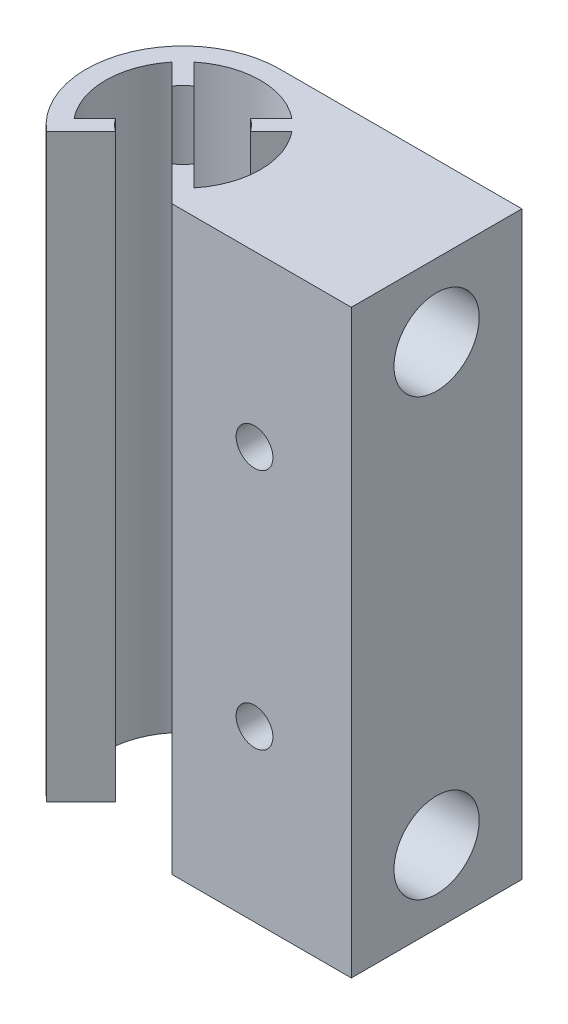
ISO-10303-21;
HEADER;
FILE_DESCRIPTION(('STEP AP214'),'2;1');
FILE_NAME('part.step','',(''),(''),'','','');
FILE_SCHEMA(('AUTOMOTIVE_DESIGN { 1 0 10303 214 1 1 1 1 }'));
ENDSEC;
DATA;
#1=APPLICATION_CONTEXT('core data for automotive mechanical design processes');
#2=APPLICATION_PROTOCOL_DEFINITION('international standard','automotive_design',2000,#1);
#3=PRODUCT_CONTEXT('',#1,'mechanical');
#4=PRODUCT('Part','Part','',(#3));
#5=PRODUCT_RELATED_PRODUCT_CATEGORY('part','',(#4));
#6=PRODUCT_DEFINITION_FORMATION('','',#4);
#7=PRODUCT_DEFINITION_CONTEXT('part definition',#1,'design');
#8=PRODUCT_DEFINITION('design','',#6,#7);
#9=PRODUCT_DEFINITION_SHAPE('','',#8);
#10=(LENGTH_UNIT() NAMED_UNIT(*) SI_UNIT(.MILLI.,.METRE.));
#11=(NAMED_UNIT(*) PLANE_ANGLE_UNIT() SI_UNIT($,.RADIAN.));
#12=(NAMED_UNIT(*) SI_UNIT($,.STERADIAN.) SOLID_ANGLE_UNIT());
#13=UNCERTAINTY_MEASURE_WITH_UNIT(LENGTH_MEASURE(1.E-05),#10,'distance_accuracy_value','');
#14=(GEOMETRIC_REPRESENTATION_CONTEXT(3) GLOBAL_UNCERTAINTY_ASSIGNED_CONTEXT((#13)) GLOBAL_UNIT_ASSIGNED_CONTEXT((#10,
#11,#12)) REPRESENTATION_CONTEXT('',''));
#15=CARTESIAN_POINT('',(0.,0.,0.));
#16=DIRECTION('',(0.,0.,1.));
#17=DIRECTION('',(1.,0.,0.));
#18=AXIS2_PLACEMENT_3D('',#15,#16,#17);
#19=CARTESIAN_POINT('',(-10.,60.,0.));
#20=DIRECTION('',(0.,-1.,0.));
#21=DIRECTION('',(0.,0.,-1.));
#22=AXIS2_PLACEMENT_3D('',#19,#20,#21);
#23=CYLINDRICAL_SURFACE('',#22,8.);
#24=CARTESIAN_POINT('',(-10.,0.,0.));
#25=DIRECTION('',(0.,-1.,0.));
#26=DIRECTION('',(0.,0.,1.));
#27=AXIS2_PLACEMENT_3D('',#24,#25,#26);
#28=CIRCLE('',#27,8.);
#29=CARTESIAN_POINT('',(-3.80581566326265,0.,-5.06281348683888));
#30=VERTEX_POINT('',#29);
#31=CARTESIAN_POINT('',(-3.80581566326265,0.,5.06281348683888));
#32=VERTEX_POINT('',#31);
#33=EDGE_CURVE('E195',#30,#32,#28,.T.);
#34=ORIENTED_EDGE('',*,*,#33,.T.);
#35=DIRECTION('',(0.,-1.,0.));
#36=VECTOR('',#35,1.);
#37=CARTESIAN_POINT('',(-3.80581566326265,60.,5.06281348683888));
#38=LINE('',#37,#36);
#39=CARTESIAN_POINT('',(-3.80581566326265,60.,5.06281348683888));
#40=VERTEX_POINT('',#39);
#41=EDGE_CURVE('E11',#40,#32,#38,.T.);
#42=ORIENTED_EDGE('',*,*,#41,.F.);
#43=CARTESIAN_POINT('',(-10.,60.,0.));
#44=DIRECTION('',(0.,-1.,0.));
#45=DIRECTION('',(0.,0.,1.));
#46=AXIS2_PLACEMENT_3D('',#43,#44,#45);
#47=CIRCLE('',#46,8.);
#48=CARTESIAN_POINT('',(-3.80581566326265,60.,-5.06281348683888));
#49=VERTEX_POINT('',#48);
#50=EDGE_CURVE('E234',#49,#40,#47,.T.);
#51=ORIENTED_EDGE('',*,*,#50,.F.);
#52=DIRECTION('',(0.,-1.,0.));
#53=VECTOR('',#52,1.);
#54=CARTESIAN_POINT('',(-3.80581566326265,60.,-5.06281348683888));
#55=LINE('',#54,#53);
#56=EDGE_CURVE('E191',#49,#30,#55,.T.);
#57=ORIENTED_EDGE('',*,*,#56,.T.);
#58=EDGE_LOOP('',(#34,#42,#51,#57));
#59=FACE_BOUND('',#58,.T.);
#60=ADVANCED_FACE('F33',(#59),#23,.F.);
#61=CARTESIAN_POINT('',(-5.94432890172773,60.,2.9243002483738));
#62=DIRECTION('',(-0.707106781186547,0.,0.707106781186548));
#63=DIRECTION('',(0.707106781186548,0.,0.707106781186547));
#64=AXIS2_PLACEMENT_3D('',#61,#62,#63);
#65=PLANE('',#64);
#66=DIRECTION('',(-0.707106781186548,0.,-0.707106781186547));
#67=VECTOR('',#66,1.);
#68=CARTESIAN_POINT('',(-5.94432890172773,0.,2.9243002483738));
#69=LINE('',#68,#67);
#70=CARTESIAN_POINT('',(-5.94432890172773,0.,2.9243002483738));
#71=VERTEX_POINT('',#70);
#72=EDGE_CURVE('E198',#32,#71,#69,.T.);
#73=ORIENTED_EDGE('',*,*,#72,.T.);
#74=DIRECTION('',(0.,-1.,0.));
#75=VECTOR('',#74,1.);
#76=CARTESIAN_POINT('',(-5.94432890172773,60.,2.9243002483738));
#77=LINE('',#76,#75);
#78=CARTESIAN_POINT('',(-5.94432890172773,60.,2.9243002483738));
#79=VERTEX_POINT('',#78);
#80=EDGE_CURVE('E41',#79,#71,#77,.T.);
#81=ORIENTED_EDGE('',*,*,#80,.F.);
#82=DIRECTION('',(-0.707106781186548,0.,-0.707106781186547));
#83=VECTOR('',#82,1.);
#84=CARTESIAN_POINT('',(-5.94432890172773,60.,2.9243002483738));
#85=LINE('',#84,#83);
#86=EDGE_CURVE('E125',#40,#79,#85,.T.);
#87=ORIENTED_EDGE('',*,*,#86,.F.);
#88=ORIENTED_EDGE('',*,*,#41,.T.);
#89=EDGE_LOOP('',(#73,#81,#87,#88));
#90=FACE_BOUND('',#89,.T.);
#91=ADVANCED_FACE('F346',(#90),#65,.F.);
#92=CARTESIAN_POINT('',(-10.,60.,0.));
#93=DIRECTION('',(0.,-1.,0.));
#94=DIRECTION('',(0.,0.,-1.));
#95=AXIS2_PLACEMENT_3D('',#92,#93,#94);
#96=CYLINDRICAL_SURFACE('',#95,5.);
#97=CARTESIAN_POINT('',(-10.,0.,0.));
#98=DIRECTION('',(0.,-1.,0.));
#99=DIRECTION('',(0.,0.,1.));
#100=AXIS2_PLACEMENT_3D('',#97,#98,#99);
#101=CIRCLE('',#100,5.);
#102=CARTESIAN_POINT('',(-7.07569975162621,0.,4.05567109827227));
#103=VERTEX_POINT('',#102);
#104=EDGE_CURVE('E201',#71,#103,#101,.T.);
#105=ORIENTED_EDGE('',*,*,#104,.T.);
#106=DIRECTION('',(0.,-1.,0.));
#107=VECTOR('',#106,1.);
#108=CARTESIAN_POINT('',(-7.07569975162621,60.,4.05567109827227));
#109=LINE('',#108,#107);
#110=CARTESIAN_POINT('',(-7.07569975162621,60.,4.05567109827227));
#111=VERTEX_POINT('',#110);
#112=EDGE_CURVE('E274',#111,#103,#109,.T.);
#113=ORIENTED_EDGE('',*,*,#112,.F.);
#114=CARTESIAN_POINT('',(-10.,60.,0.));
#115=DIRECTION('',(0.,-1.,0.));
#116=DIRECTION('',(0.,0.,1.));
#117=AXIS2_PLACEMENT_3D('',#114,#115,#116);
#118=CIRCLE('',#117,5.);
#119=EDGE_CURVE('E282',#79,#111,#118,.T.);
#120=ORIENTED_EDGE('',*,*,#119,.F.);
#121=ORIENTED_EDGE('',*,*,#80,.T.);
#122=EDGE_LOOP('',(#105,#113,#120,#121));
#123=FACE_BOUND('',#122,.T.);
#124=ADVANCED_FACE('F280',(#123),#96,.F.);
#125=CARTESIAN_POINT('',(-7.07569975162621,60.,4.05567109827227));
#126=DIRECTION('',(0.707106781186547,0.,-0.707106781186548));
#127=DIRECTION('',(-0.707106781186548,0.,-0.707106781186547));
#128=AXIS2_PLACEMENT_3D('',#125,#126,#127);
#129=PLANE('',#128);
#130=DIRECTION('',(0.707106781186548,0.,0.707106781186547));
#131=VECTOR('',#130,1.);
#132=CARTESIAN_POINT('',(-7.07569975162621,0.,4.05567109827227));
#133=LINE('',#132,#131);
#134=CARTESIAN_POINT('',(-3.5172813502668,0.,7.61408949963168));
#135=VERTEX_POINT('',#134);
#136=EDGE_CURVE('E203',#103,#135,#133,.T.);
#137=ORIENTED_EDGE('',*,*,#136,.T.);
#138=DIRECTION('',(0.,-1.,0.));
#139=VECTOR('',#138,1.);
#140=CARTESIAN_POINT('',(-3.5172813502668,60.,7.61408949963168));
#141=LINE('',#140,#139);
#142=CARTESIAN_POINT('',(-3.5172813502668,60.,7.61408949963168));
#143=VERTEX_POINT('',#142);
#144=EDGE_CURVE('E271',#143,#135,#141,.T.);
#145=ORIENTED_EDGE('',*,*,#144,.F.);
#146=DIRECTION('',(0.707106781186548,0.,0.707106781186547));
#147=VECTOR('',#146,1.);
#148=CARTESIAN_POINT('',(-7.07569975162621,60.,4.05567109827227));
#149=LINE('',#148,#147);
#150=EDGE_CURVE('E299',#111,#143,#149,.T.);
#151=ORIENTED_EDGE('',*,*,#150,.F.);
#152=ORIENTED_EDGE('',*,*,#112,.T.);
#153=EDGE_LOOP('',(#137,#145,#151,#152));
#154=FACE_BOUND('',#153,.T.);
#155=ADVANCED_FACE('F290',(#154),#129,.F.);
#156=CARTESIAN_POINT('',(-3.5172813502668,60.,7.61408949963168));
#157=DIRECTION('',(0.,0.,-1.));
#158=DIRECTION('',(-1.,0.,0.));
#159=AXIS2_PLACEMENT_3D('',#156,#157,#158);
#160=PLANE('',#159);
#161=CARTESIAN_POINT('',(4.99999999999999,17.5,7.61408949963168));
#162=DIRECTION('',(0.,0.,-1.));
#163=DIRECTION('',(-1.,0.,0.));
#164=AXIS2_PLACEMENT_3D('',#161,#162,#163);
#165=CIRCLE('',#164,1.9);
#166=CARTESIAN_POINT('',(3.1,17.5,7.61408949963168));
#167=VERTEX_POINT('',#166);
#168=EDGE_CURVE('E529',#167,#167,#165,.F.);
#169=ORIENTED_EDGE('',*,*,#168,.F.);
#170=EDGE_LOOP('',(#169));
#171=FACE_BOUND('',#170,.T.);
#172=CARTESIAN_POINT('',(5.,42.5,7.61408949963168));
#173=DIRECTION('',(0.,0.,-1.));
#174=DIRECTION('',(-1.,0.,0.));
#175=AXIS2_PLACEMENT_3D('',#172,#173,#174);
#176=CIRCLE('',#175,1.9);
#177=CARTESIAN_POINT('',(3.1,42.5,7.61408949963168));
#178=VERTEX_POINT('',#177);
#179=EDGE_CURVE('E199',#178,#178,#176,.F.);
#180=ORIENTED_EDGE('',*,*,#179,.F.);
#181=EDGE_LOOP('',(#180));
#182=FACE_BOUND('',#181,.T.);
#183=DIRECTION('',(1.,0.,0.));
#184=VECTOR('',#183,1.);
#185=CARTESIAN_POINT('',(-3.5172813502668,0.,7.61408949963168));
#186=LINE('',#185,#184);
#187=CARTESIAN_POINT('',(15.,0.,7.61408949963168));
#188=VERTEX_POINT('',#187);
#189=EDGE_CURVE('E205',#135,#188,#186,.T.);
#190=ORIENTED_EDGE('',*,*,#189,.T.);
#191=DIRECTION('',(0.,-1.,0.));
#192=VECTOR('',#191,1.);
#193=CARTESIAN_POINT('',(15.,60.,7.61408949963168));
#194=LINE('',#193,#192);
#195=CARTESIAN_POINT('',(15.,60.,7.61408949963168));
#196=VERTEX_POINT('',#195);
#197=EDGE_CURVE('E268',#196,#188,#194,.T.);
#198=ORIENTED_EDGE('',*,*,#197,.F.);
#199=DIRECTION('',(1.,0.,0.));
#200=VECTOR('',#199,1.);
#201=CARTESIAN_POINT('',(-3.5172813502668,60.,7.61408949963168));
#202=LINE('',#201,#200);
#203=EDGE_CURVE('E296',#143,#196,#202,.T.);
#204=ORIENTED_EDGE('',*,*,#203,.F.);
#205=ORIENTED_EDGE('',*,*,#144,.T.);
#206=EDGE_LOOP('',(#190,#198,#204,#205));
#207=FACE_BOUND('',#206,.T.);
#208=ADVANCED_FACE('F294',(#171,#182,#207),#160,.F.);
#209=CARTESIAN_POINT('',(15.,60.,-1.19295525018416));
#210=DIRECTION('',(-1.,0.,0.));
#211=DIRECTION('',(0.,0.,1.));
#212=AXIS2_PLACEMENT_3D('',#209,#210,#211);
#213=PLANE('',#212);
#214=CARTESIAN_POINT('',(15.,52.5,-1.19295525018416));
#215=DIRECTION('',(1.,0.,0.));
#216=DIRECTION('',(0.,0.,-1.));
#217=AXIS2_PLACEMENT_3D('',#214,#215,#216);
#218=CIRCLE('',#217,4.4);
#219=CARTESIAN_POINT('',(15.,52.5,-5.59295525018416));
#220=VERTEX_POINT('',#219);
#221=EDGE_CURVE('E516',#220,#220,#218,.T.);
#222=ORIENTED_EDGE('',*,*,#221,.F.);
#223=EDGE_LOOP('',(#222));
#224=FACE_BOUND('',#223,.T.);
#225=CARTESIAN_POINT('',(15.,7.5,-1.19295525018417));
#226=DIRECTION('',(1.,0.,0.));
#227=DIRECTION('',(0.,0.,-1.));
#228=AXIS2_PLACEMENT_3D('',#225,#226,#227);
#229=CIRCLE('',#228,4.4);
#230=CARTESIAN_POINT('',(15.,7.5,-5.59295525018417));
#231=VERTEX_POINT('',#230);
#232=EDGE_CURVE('E515',#231,#231,#229,.T.);
#233=ORIENTED_EDGE('',*,*,#232,.F.);
#234=EDGE_LOOP('',(#233));
#235=FACE_BOUND('',#234,.T.);
#236=DIRECTION('',(0.,0.,-1.));
#237=VECTOR('',#236,1.);
#238=CARTESIAN_POINT('',(15.,0.,-1.19295525018416));
#239=LINE('',#238,#237);
#240=CARTESIAN_POINT('',(15.,0.,-10.));
#241=VERTEX_POINT('',#240);
#242=EDGE_CURVE('E208',#188,#241,#239,.T.);
#243=ORIENTED_EDGE('',*,*,#242,.T.);
#244=DIRECTION('',(0.,-1.,0.));
#245=VECTOR('',#244,1.);
#246=CARTESIAN_POINT('',(15.,60.,-10.));
#247=LINE('',#246,#245);
#248=CARTESIAN_POINT('',(15.,60.,-10.));
#249=VERTEX_POINT('',#248);
#250=EDGE_CURVE('E265',#249,#241,#247,.T.);
#251=ORIENTED_EDGE('',*,*,#250,.F.);
#252=DIRECTION('',(0.,0.,-1.));
#253=VECTOR('',#252,1.);
#254=CARTESIAN_POINT('',(15.,60.,-1.19295525018416));
#255=LINE('',#254,#253);
#256=EDGE_CURVE('E298',#196,#249,#255,.T.);
#257=ORIENTED_EDGE('',*,*,#256,.F.);
#258=ORIENTED_EDGE('',*,*,#197,.T.);
#259=EDGE_LOOP('',(#243,#251,#257,#258));
#260=FACE_BOUND('',#259,.T.);
#261=ADVANCED_FACE('F359',(#224,#235,#260),#213,.F.);
#262=CARTESIAN_POINT('',(0.,60.,-10.));
#263=DIRECTION('',(0.,0.,1.));
#264=DIRECTION('',(1.,0.,0.));
#265=AXIS2_PLACEMENT_3D('',#262,#263,#264);
#266=PLANE('',#265);
#267=CARTESIAN_POINT('',(4.99999999999999,17.5,-10.));
#268=DIRECTION('',(0.,0.,-1.));
#269=DIRECTION('',(-1.,0.,0.));
#270=AXIS2_PLACEMENT_3D('',#267,#268,#269);
#271=CIRCLE('',#270,1.9);
#272=CARTESIAN_POINT('',(3.1,17.5,-10.));
#273=VERTEX_POINT('',#272);
#274=EDGE_CURVE('E525',#273,#273,#271,.T.);
#275=ORIENTED_EDGE('',*,*,#274,.F.);
#276=EDGE_LOOP('',(#275));
#277=FACE_BOUND('',#276,.T.);
#278=CARTESIAN_POINT('',(5.,42.5,-10.));
#279=DIRECTION('',(0.,0.,-1.));
#280=DIRECTION('',(-1.,0.,0.));
#281=AXIS2_PLACEMENT_3D('',#278,#279,#280);
#282=CIRCLE('',#281,1.9);
#283=CARTESIAN_POINT('',(3.1,42.5,-10.));
#284=VERTEX_POINT('',#283);
#285=EDGE_CURVE('E532',#284,#284,#282,.T.);
#286=ORIENTED_EDGE('',*,*,#285,.F.);
#287=EDGE_LOOP('',(#286));
#288=FACE_BOUND('',#287,.T.);
#289=DIRECTION('',(-1.,0.,0.));
#290=VECTOR('',#289,1.);
#291=CARTESIAN_POINT('',(0.,0.,-10.));
#292=LINE('',#291,#290);
#293=CARTESIAN_POINT('',(-10.,0.,-10.));
#294=VERTEX_POINT('',#293);
#295=EDGE_CURVE('E211',#241,#294,#292,.T.);
#296=ORIENTED_EDGE('',*,*,#295,.T.);
#297=DIRECTION('',(0.,-1.,0.));
#298=VECTOR('',#297,1.);
#299=CARTESIAN_POINT('',(-10.,60.,-10.));
#300=LINE('',#299,#298);
#301=CARTESIAN_POINT('',(-10.,60.,-10.));
#302=VERTEX_POINT('',#301);
#303=EDGE_CURVE('E262',#302,#294,#300,.T.);
#304=ORIENTED_EDGE('',*,*,#303,.F.);
#305=DIRECTION('',(-1.,0.,0.));
#306=VECTOR('',#305,1.);
#307=CARTESIAN_POINT('',(0.,60.,-10.));
#308=LINE('',#307,#306);
#309=EDGE_CURVE('E301',#249,#302,#308,.T.);
#310=ORIENTED_EDGE('',*,*,#309,.F.);
#311=ORIENTED_EDGE('',*,*,#250,.T.);
#312=EDGE_LOOP('',(#296,#304,#310,#311));
#313=FACE_BOUND('',#312,.T.);
#314=ADVANCED_FACE('F363',(#277,#288,#313),#266,.F.);
#315=CARTESIAN_POINT('',(-10.,60.,0.));
#316=DIRECTION('',(0.,-1.,0.));
#317=DIRECTION('',(0.,0.,-1.));
#318=AXIS2_PLACEMENT_3D('',#315,#316,#317);
#319=CYLINDRICAL_SURFACE('',#318,10.);
#320=CARTESIAN_POINT('',(-10.,0.,0.));
#321=DIRECTION('',(0.,1.,0.));
#322=DIRECTION('',(0.,0.,1.));
#323=AXIS2_PLACEMENT_3D('',#320,#321,#322);
#324=CIRCLE('',#323,10.);
#325=CARTESIAN_POINT('',(-16.4827186497332,0.,7.61408949963168));
#326=VERTEX_POINT('',#325);
#327=EDGE_CURVE('E213',#294,#326,#324,.T.);
#328=ORIENTED_EDGE('',*,*,#327,.T.);
#329=DIRECTION('',(0.,-1.,0.));
#330=VECTOR('',#329,1.);
#331=CARTESIAN_POINT('',(-16.4827186497332,60.,7.61408949963168));
#332=LINE('',#331,#330);
#333=CARTESIAN_POINT('',(-16.4827186497332,60.,7.61408949963168));
#334=VERTEX_POINT('',#333);
#335=EDGE_CURVE('E259',#334,#326,#332,.T.);
#336=ORIENTED_EDGE('',*,*,#335,.F.);
#337=CARTESIAN_POINT('',(-10.,60.,0.));
#338=DIRECTION('',(0.,1.,0.));
#339=DIRECTION('',(0.,0.,1.));
#340=AXIS2_PLACEMENT_3D('',#337,#338,#339);
#341=CIRCLE('',#340,10.);
#342=EDGE_CURVE('E307',#302,#334,#341,.T.);
#343=ORIENTED_EDGE('',*,*,#342,.F.);
#344=ORIENTED_EDGE('',*,*,#303,.T.);
#345=EDGE_LOOP('',(#328,#336,#343,#344));
#346=FACE_BOUND('',#345,.T.);
#347=ADVANCED_FACE('F367',(#346),#319,.T.);
#348=CARTESIAN_POINT('',(-12.9243002483738,60.,4.05567109827227));
#349=DIRECTION('',(-0.707106781186548,0.,-0.707106781186547));
#350=DIRECTION('',(-0.707106781186547,0.,0.707106781186548));
#351=AXIS2_PLACEMENT_3D('',#348,#349,#350);
#352=PLANE('',#351);
#353=DIRECTION('',(0.707106781186547,0.,-0.707106781186548));
#354=VECTOR('',#353,1.);
#355=CARTESIAN_POINT('',(-12.9243002483738,0.,4.05567109827227));
#356=LINE('',#355,#354);
#357=CARTESIAN_POINT('',(-12.9243002483738,0.,4.05567109827227));
#358=VERTEX_POINT('',#357);
#359=EDGE_CURVE('E215',#326,#358,#356,.T.);
#360=ORIENTED_EDGE('',*,*,#359,.T.);
#361=DIRECTION('',(0.,-1.,0.));
#362=VECTOR('',#361,1.);
#363=CARTESIAN_POINT('',(-12.9243002483738,60.,4.05567109827227));
#364=LINE('',#363,#362);
#365=CARTESIAN_POINT('',(-12.9243002483738,60.,4.05567109827227));
#366=VERTEX_POINT('',#365);
#367=EDGE_CURVE('E256',#366,#358,#364,.T.);
#368=ORIENTED_EDGE('',*,*,#367,.F.);
#369=DIRECTION('',(0.707106781186547,0.,-0.707106781186548));
#370=VECTOR('',#369,1.);
#371=CARTESIAN_POINT('',(-12.9243002483738,60.,4.05567109827227));
#372=LINE('',#371,#370);
#373=EDGE_CURVE('E309',#334,#366,#372,.T.);
#374=ORIENTED_EDGE('',*,*,#373,.F.);
#375=ORIENTED_EDGE('',*,*,#335,.T.);
#376=EDGE_LOOP('',(#360,#368,#374,#375));
#377=FACE_BOUND('',#376,.T.);
#378=ADVANCED_FACE('F371',(#377),#352,.F.);
#379=CARTESIAN_POINT('',(-10.,60.,0.));
#380=DIRECTION('',(0.,-1.,0.));
#381=DIRECTION('',(0.,0.,-1.));
#382=AXIS2_PLACEMENT_3D('',#379,#380,#381);
#383=CYLINDRICAL_SURFACE('',#382,4.99999999999995);
#384=CARTESIAN_POINT('',(-10.,0.,0.));
#385=DIRECTION('',(0.,-1.,0.));
#386=DIRECTION('',(0.,0.,1.));
#387=AXIS2_PLACEMENT_3D('',#384,#385,#386);
#388=CIRCLE('',#387,4.99999999999995);
#389=CARTESIAN_POINT('',(-14.0556710982722,0.,2.92430024837375));
#390=VERTEX_POINT('',#389);
#391=EDGE_CURVE('E217',#358,#390,#388,.T.);
#392=ORIENTED_EDGE('',*,*,#391,.T.);
#393=DIRECTION('',(0.,-1.,0.));
#394=VECTOR('',#393,1.);
#395=CARTESIAN_POINT('',(-14.0556710982722,60.,2.92430024837375));
#396=LINE('',#395,#394);
#397=CARTESIAN_POINT('',(-14.0556710982722,60.,2.92430024837375));
#398=VERTEX_POINT('',#397);
#399=EDGE_CURVE('E253',#398,#390,#396,.T.);
#400=ORIENTED_EDGE('',*,*,#399,.F.);
#401=CARTESIAN_POINT('',(-10.,60.,0.));
#402=DIRECTION('',(0.,-1.,0.));
#403=DIRECTION('',(0.,0.,1.));
#404=AXIS2_PLACEMENT_3D('',#401,#402,#403);
#405=CIRCLE('',#404,4.99999999999995);
#406=EDGE_CURVE('E311',#366,#398,#405,.T.);
#407=ORIENTED_EDGE('',*,*,#406,.F.);
#408=ORIENTED_EDGE('',*,*,#367,.T.);
#409=EDGE_LOOP('',(#392,#400,#407,#408));
#410=FACE_BOUND('',#409,.T.);
#411=ADVANCED_FACE('F375',(#410),#383,.F.);
#412=CARTESIAN_POINT('',(-14.0556710982722,60.,2.92430024837372));
#413=DIRECTION('',(0.707106781186546,0.,0.707106781186549));
#414=DIRECTION('',(0.707106781186549,0.,-0.707106781186546));
#415=AXIS2_PLACEMENT_3D('',#412,#413,#414);
#416=PLANE('',#415);
#417=DIRECTION('',(-0.707106781186549,0.,0.707106781186546));
#418=VECTOR('',#417,1.);
#419=CARTESIAN_POINT('',(-14.0556710982722,0.,2.92430024837372));
#420=LINE('',#419,#418);
#421=CARTESIAN_POINT('',(-16.1941843367374,0.,5.06281348683888));
#422=VERTEX_POINT('',#421);
#423=EDGE_CURVE('E219',#390,#422,#420,.T.);
#424=ORIENTED_EDGE('',*,*,#423,.T.);
#425=DIRECTION('',(0.,-1.,0.));
#426=VECTOR('',#425,1.);
#427=CARTESIAN_POINT('',(-16.1941843367374,60.,5.06281348683888));
#428=LINE('',#427,#426);
#429=CARTESIAN_POINT('',(-16.1941843367374,60.,5.06281348683888));
#430=VERTEX_POINT('',#429);
#431=EDGE_CURVE('E250',#430,#422,#428,.T.);
#432=ORIENTED_EDGE('',*,*,#431,.F.);
#433=DIRECTION('',(-0.707106781186549,0.,0.707106781186546));
#434=VECTOR('',#433,1.);
#435=CARTESIAN_POINT('',(-14.0556710982722,60.,2.92430024837372));
#436=LINE('',#435,#434);
#437=EDGE_CURVE('E313',#398,#430,#436,.T.);
#438=ORIENTED_EDGE('',*,*,#437,.F.);
#439=ORIENTED_EDGE('',*,*,#399,.T.);
#440=EDGE_LOOP('',(#424,#432,#438,#439));
#441=FACE_BOUND('',#440,.T.);
#442=ADVANCED_FACE('F379',(#441),#416,.F.);
#443=CARTESIAN_POINT('',(-10.,60.,0.));
#444=DIRECTION('',(0.,-1.,0.));
#445=DIRECTION('',(0.,0.,-1.));
#446=AXIS2_PLACEMENT_3D('',#443,#444,#445);
#447=CYLINDRICAL_SURFACE('',#446,8.);
#448=CARTESIAN_POINT('',(-10.,0.,0.));
#449=DIRECTION('',(0.,-1.,0.));
#450=DIRECTION('',(0.,0.,1.));
#451=AXIS2_PLACEMENT_3D('',#448,#449,#450);
#452=CIRCLE('',#451,8.);
#453=CARTESIAN_POINT('',(-16.1941843367374,0.,-5.06281348683887));
#454=VERTEX_POINT('',#453);
#455=EDGE_CURVE('E221',#422,#454,#452,.T.);
#456=ORIENTED_EDGE('',*,*,#455,.T.);
#457=DIRECTION('',(0.,-1.,0.));
#458=VECTOR('',#457,1.);
#459=CARTESIAN_POINT('',(-16.1941843367374,60.,-5.06281348683887));
#460=LINE('',#459,#458);
#461=CARTESIAN_POINT('',(-16.1941843367374,60.,-5.06281348683887));
#462=VERTEX_POINT('',#461);
#463=EDGE_CURVE('E247',#462,#454,#460,.T.);
#464=ORIENTED_EDGE('',*,*,#463,.F.);
#465=CARTESIAN_POINT('',(-10.,60.,0.));
#466=DIRECTION('',(0.,-1.,0.));
#467=DIRECTION('',(0.,0.,1.));
#468=AXIS2_PLACEMENT_3D('',#465,#466,#467);
#469=CIRCLE('',#468,8.);
#470=EDGE_CURVE('E315',#430,#462,#469,.T.);
#471=ORIENTED_EDGE('',*,*,#470,.F.);
#472=ORIENTED_EDGE('',*,*,#431,.T.);
#473=EDGE_LOOP('',(#456,#464,#471,#472));
#474=FACE_BOUND('',#473,.T.);
#475=ADVANCED_FACE('F383',(#474),#447,.F.);
#476=CARTESIAN_POINT('',(-14.0556710982723,60.,-2.92430024837379));
#477=DIRECTION('',(0.707106781186545,0.,-0.70710678118655));
#478=DIRECTION('',(-0.70710678118655,0.,-0.707106781186545));
#479=AXIS2_PLACEMENT_3D('',#476,#477,#478);
#480=PLANE('',#479);
#481=DIRECTION('',(0.70710678118655,0.,0.707106781186545));
#482=VECTOR('',#481,1.);
#483=CARTESIAN_POINT('',(-14.0556710982723,0.,-2.92430024837379));
#484=LINE('',#483,#482);
#485=CARTESIAN_POINT('',(-14.0556710982723,0.,-2.92430024837379));
#486=VERTEX_POINT('',#485);
#487=EDGE_CURVE('E223',#454,#486,#484,.T.);
#488=ORIENTED_EDGE('',*,*,#487,.T.);
#489=DIRECTION('',(0.,-1.,0.));
#490=VECTOR('',#489,1.);
#491=CARTESIAN_POINT('',(-14.0556710982723,60.,-2.92430024837379));
#492=LINE('',#491,#490);
#493=CARTESIAN_POINT('',(-14.0556710982723,60.,-2.92430024837379));
#494=VERTEX_POINT('',#493);
#495=EDGE_CURVE('E244',#494,#486,#492,.T.);
#496=ORIENTED_EDGE('',*,*,#495,.F.);
#497=DIRECTION('',(0.70710678118655,0.,0.707106781186545));
#498=VECTOR('',#497,1.);
#499=CARTESIAN_POINT('',(-14.0556710982723,60.,-2.92430024837379));
#500=LINE('',#499,#498);
#501=EDGE_CURVE('E317',#462,#494,#500,.T.);
#502=ORIENTED_EDGE('',*,*,#501,.F.);
#503=ORIENTED_EDGE('',*,*,#463,.T.);
#504=EDGE_LOOP('',(#488,#496,#502,#503));
#505=FACE_BOUND('',#504,.T.);
#506=ADVANCED_FACE('F387',(#505),#480,.F.);
#507=CARTESIAN_POINT('',(-10.,60.,0.));
#508=DIRECTION('',(0.,-1.,0.));
#509=DIRECTION('',(0.,0.,-1.));
#510=AXIS2_PLACEMENT_3D('',#507,#508,#509);
#511=CYLINDRICAL_SURFACE('',#510,5.);
#512=CARTESIAN_POINT('',(-10.,0.,0.));
#513=DIRECTION('',(0.,-1.,0.));
#514=DIRECTION('',(0.,0.,1.));
#515=AXIS2_PLACEMENT_3D('',#512,#513,#514);
#516=CIRCLE('',#515,5.);
#517=CARTESIAN_POINT('',(-12.9243002483738,0.,-4.05567109827227));
#518=VERTEX_POINT('',#517);
#519=EDGE_CURVE('E225',#486,#518,#516,.T.);
#520=ORIENTED_EDGE('',*,*,#519,.T.);
#521=DIRECTION('',(0.,-1.,0.));
#522=VECTOR('',#521,1.);
#523=CARTESIAN_POINT('',(-12.9243002483738,60.,-4.05567109827227));
#524=LINE('',#523,#522);
#525=CARTESIAN_POINT('',(-12.9243002483738,60.,-4.05567109827227));
#526=VERTEX_POINT('',#525);
#527=EDGE_CURVE('E241',#526,#518,#524,.T.);
#528=ORIENTED_EDGE('',*,*,#527,.F.);
#529=CARTESIAN_POINT('',(-10.,60.,0.));
#530=DIRECTION('',(0.,-1.,0.));
#531=DIRECTION('',(0.,0.,1.));
#532=AXIS2_PLACEMENT_3D('',#529,#530,#531);
#533=CIRCLE('',#532,5.);
#534=EDGE_CURVE('E319',#494,#526,#533,.T.);
#535=ORIENTED_EDGE('',*,*,#534,.F.);
#536=ORIENTED_EDGE('',*,*,#495,.T.);
#537=EDGE_LOOP('',(#520,#528,#535,#536));
#538=FACE_BOUND('',#537,.T.);
#539=ADVANCED_FACE('F391',(#538),#511,.F.);
#540=CARTESIAN_POINT('',(-15.0628134868389,60.,-6.19418433673735));
#541=DIRECTION('',(-0.707106781186548,0.,0.707106781186547));
#542=DIRECTION('',(0.707106781186547,0.,0.707106781186548));
#543=AXIS2_PLACEMENT_3D('',#540,#541,#542);
#544=PLANE('',#543);
#545=DIRECTION('',(-0.707106781186547,0.,-0.707106781186548));
#546=VECTOR('',#545,1.);
#547=CARTESIAN_POINT('',(-15.0628134868389,0.,-6.19418433673735));
#548=LINE('',#547,#546);
#549=CARTESIAN_POINT('',(-15.0628134868389,0.,-6.19418433673735));
#550=VERTEX_POINT('',#549);
#551=EDGE_CURVE('E227',#518,#550,#548,.T.);
#552=ORIENTED_EDGE('',*,*,#551,.T.);
#553=DIRECTION('',(0.,-1.,0.));
#554=VECTOR('',#553,1.);
#555=CARTESIAN_POINT('',(-15.0628134868389,60.,-6.19418433673735));
#556=LINE('',#555,#554);
#557=CARTESIAN_POINT('',(-15.0628134868389,60.,-6.19418433673735));
#558=VERTEX_POINT('',#557);
#559=EDGE_CURVE('E238',#558,#550,#556,.T.);
#560=ORIENTED_EDGE('',*,*,#559,.F.);
#561=DIRECTION('',(-0.707106781186547,0.,-0.707106781186548));
#562=VECTOR('',#561,1.);
#563=CARTESIAN_POINT('',(-15.0628134868389,60.,-6.19418433673735));
#564=LINE('',#563,#562);
#565=EDGE_CURVE('E321',#526,#558,#564,.T.);
#566=ORIENTED_EDGE('',*,*,#565,.F.);
#567=ORIENTED_EDGE('',*,*,#527,.T.);
#568=EDGE_LOOP('',(#552,#560,#566,#567));
#569=FACE_BOUND('',#568,.T.);
#570=ADVANCED_FACE('F327',(#569),#544,.F.);
#571=CARTESIAN_POINT('',(-10.,60.,0.));
#572=DIRECTION('',(0.,-1.,0.));
#573=DIRECTION('',(0.,0.,-1.));
#574=AXIS2_PLACEMENT_3D('',#571,#572,#573);
#575=CYLINDRICAL_SURFACE('',#574,8.);
#576=CARTESIAN_POINT('',(-10.,0.,0.));
#577=DIRECTION('',(0.,-1.,0.));
#578=DIRECTION('',(0.,0.,1.));
#579=AXIS2_PLACEMENT_3D('',#576,#577,#578);
#580=CIRCLE('',#579,8.);
#581=CARTESIAN_POINT('',(-4.93718651316113,0.,-6.19418433673735));
#582=VERTEX_POINT('',#581);
#583=EDGE_CURVE('E229',#550,#582,#580,.T.);
#584=ORIENTED_EDGE('',*,*,#583,.T.);
#585=DIRECTION('',(0.,-1.,0.));
#586=VECTOR('',#585,1.);
#587=CARTESIAN_POINT('',(-4.93718651316113,60.,-6.19418433673735));
#588=LINE('',#587,#586);
#589=CARTESIAN_POINT('',(-4.93718651316113,60.,-6.19418433673735));
#590=VERTEX_POINT('',#589);
#591=EDGE_CURVE('E186',#590,#582,#588,.T.);
#592=ORIENTED_EDGE('',*,*,#591,.F.);
#593=CARTESIAN_POINT('',(-10.,60.,0.));
#594=DIRECTION('',(0.,-1.,0.));
#595=DIRECTION('',(0.,0.,1.));
#596=AXIS2_PLACEMENT_3D('',#593,#594,#595);
#597=CIRCLE('',#596,8.);
#598=EDGE_CURVE('E177',#558,#590,#597,.T.);
#599=ORIENTED_EDGE('',*,*,#598,.F.);
#600=ORIENTED_EDGE('',*,*,#559,.T.);
#601=EDGE_LOOP('',(#584,#592,#599,#600));
#602=FACE_BOUND('',#601,.T.);
#603=ADVANCED_FACE('F331',(#602),#575,.F.);
#604=CARTESIAN_POINT('',(-7.07569975162621,60.,-4.05567109827227));
#605=DIRECTION('',(0.707106781186547,0.,0.707106781186547));
#606=DIRECTION('',(0.707106781186548,0.,-0.707106781186548));
#607=AXIS2_PLACEMENT_3D('',#604,#605,#606);
#608=PLANE('',#607);
#609=DIRECTION('',(-0.707106781186547,0.,0.707106781186547));
#610=VECTOR('',#609,1.);
#611=CARTESIAN_POINT('',(-7.07569975162621,0.,-4.05567109827227));
#612=LINE('',#611,#610);
#613=CARTESIAN_POINT('',(-7.07569975162621,0.,-4.05567109827227));
#614=VERTEX_POINT('',#613);
#615=EDGE_CURVE('E185',#582,#614,#612,.T.);
#616=ORIENTED_EDGE('',*,*,#615,.T.);
#617=DIRECTION('',(0.,-1.,0.));
#618=VECTOR('',#617,1.);
#619=CARTESIAN_POINT('',(-7.07569975162621,60.,-4.05567109827227));
#620=LINE('',#619,#618);
#621=CARTESIAN_POINT('',(-7.07569975162621,60.,-4.05567109827227));
#622=VERTEX_POINT('',#621);
#623=EDGE_CURVE('E182',#622,#614,#620,.T.);
#624=ORIENTED_EDGE('',*,*,#623,.F.);
#625=DIRECTION('',(-0.707106781186547,0.,0.707106781186547));
#626=VECTOR('',#625,1.);
#627=CARTESIAN_POINT('',(-7.07569975162621,60.,-4.05567109827227));
#628=LINE('',#627,#626);
#629=EDGE_CURVE('E171',#590,#622,#628,.T.);
#630=ORIENTED_EDGE('',*,*,#629,.F.);
#631=ORIENTED_EDGE('',*,*,#591,.T.);
#632=EDGE_LOOP('',(#616,#624,#630,#631));
#633=FACE_BOUND('',#632,.T.);
#634=ADVANCED_FACE('F183',(#633),#608,.F.);
#635=CARTESIAN_POINT('',(-10.,60.,0.));
#636=DIRECTION('',(0.,-1.,0.));
#637=DIRECTION('',(0.,0.,-1.));
#638=AXIS2_PLACEMENT_3D('',#635,#636,#637);
#639=CYLINDRICAL_SURFACE('',#638,5.);
#640=CARTESIAN_POINT('',(-10.,0.,0.));
#641=DIRECTION('',(0.,-1.,0.));
#642=DIRECTION('',(0.,0.,1.));
#643=AXIS2_PLACEMENT_3D('',#640,#641,#642);
#644=CIRCLE('',#643,5.);
#645=CARTESIAN_POINT('',(-5.94432890172773,0.,-2.92430024837379));
#646=VERTEX_POINT('',#645);
#647=EDGE_CURVE('E111',#614,#646,#644,.T.);
#648=ORIENTED_EDGE('',*,*,#647,.T.);
#649=DIRECTION('',(0.,-1.,0.));
#650=VECTOR('',#649,1.);
#651=CARTESIAN_POINT('',(-5.94432890172773,60.,-2.92430024837379));
#652=LINE('',#651,#650);
#653=CARTESIAN_POINT('',(-5.94432890172773,60.,-2.92430024837379));
#654=VERTEX_POINT('',#653);
#655=EDGE_CURVE('E187',#654,#646,#652,.T.);
#656=ORIENTED_EDGE('',*,*,#655,.F.);
#657=CARTESIAN_POINT('',(-10.,60.,0.));
#658=DIRECTION('',(0.,-1.,0.));
#659=DIRECTION('',(0.,0.,1.));
#660=AXIS2_PLACEMENT_3D('',#657,#658,#659);
#661=CIRCLE('',#660,5.);
#662=EDGE_CURVE('E175',#622,#654,#661,.T.);
#663=ORIENTED_EDGE('',*,*,#662,.F.);
#664=ORIENTED_EDGE('',*,*,#623,.T.);
#665=EDGE_LOOP('',(#648,#656,#663,#664));
#666=FACE_BOUND('',#665,.T.);
#667=ADVANCED_FACE('F189',(#666),#639,.F.);
#668=CARTESIAN_POINT('',(-5.94432890172773,60.,-2.92430024837379));
#669=DIRECTION('',(-0.707106781186547,0.,-0.707106781186548));
#670=DIRECTION('',(-0.707106781186548,0.,0.707106781186547));
#671=AXIS2_PLACEMENT_3D('',#668,#669,#670);
#672=PLANE('',#671);
#673=DIRECTION('',(0.707106781186548,0.,-0.707106781186547));
#674=VECTOR('',#673,1.);
#675=CARTESIAN_POINT('',(-5.94432890172773,0.,-2.92430024837379));
#676=LINE('',#675,#674);
#677=EDGE_CURVE('E117',#646,#30,#676,.T.);
#678=ORIENTED_EDGE('',*,*,#677,.T.);
#679=ORIENTED_EDGE('',*,*,#56,.F.);
#680=DIRECTION('',(0.707106781186548,0.,-0.707106781186547));
#681=VECTOR('',#680,1.);
#682=CARTESIAN_POINT('',(-5.94432890172773,60.,-2.92430024837379));
#683=LINE('',#682,#681);
#684=EDGE_CURVE('E49',#654,#49,#683,.T.);
#685=ORIENTED_EDGE('',*,*,#684,.F.);
#686=ORIENTED_EDGE('',*,*,#655,.T.);
#687=EDGE_LOOP('',(#678,#679,#685,#686));
#688=FACE_BOUND('',#687,.T.);
#689=ADVANCED_FACE('F335',(#688),#672,.F.);
#690=CARTESIAN_POINT('',(-10.,60.,0.));
#691=DIRECTION('',(0.,1.,0.));
#692=DIRECTION('',(0.,0.,1.));
#693=AXIS2_PLACEMENT_3D('',#690,#691,#692);
#694=PLANE('',#693);
#695=ORIENTED_EDGE('',*,*,#50,.T.);
#696=ORIENTED_EDGE('',*,*,#86,.T.);
#697=ORIENTED_EDGE('',*,*,#119,.T.);
#698=ORIENTED_EDGE('',*,*,#150,.T.);
#699=ORIENTED_EDGE('',*,*,#203,.T.);
#700=ORIENTED_EDGE('',*,*,#256,.T.);
#701=ORIENTED_EDGE('',*,*,#309,.T.);
#702=ORIENTED_EDGE('',*,*,#342,.T.);
#703=ORIENTED_EDGE('',*,*,#373,.T.);
#704=ORIENTED_EDGE('',*,*,#406,.T.);
#705=ORIENTED_EDGE('',*,*,#437,.T.);
#706=ORIENTED_EDGE('',*,*,#470,.T.);
#707=ORIENTED_EDGE('',*,*,#501,.T.);
#708=ORIENTED_EDGE('',*,*,#534,.T.);
#709=ORIENTED_EDGE('',*,*,#565,.T.);
#710=ORIENTED_EDGE('',*,*,#598,.T.);
#711=ORIENTED_EDGE('',*,*,#629,.T.);
#712=ORIENTED_EDGE('',*,*,#662,.T.);
#713=ORIENTED_EDGE('',*,*,#684,.T.);
#714=EDGE_LOOP('',(#695,#696,#697,#698,#699,#700,#701,#702,#703,#704,#705,#706,#707,#708,#709,
#710,#711,#712,#713));
#715=FACE_BOUND('',#714,.T.);
#716=ADVANCED_FACE('F173',(#715),#694,.T.);
#717=CARTESIAN_POINT('',(-10.,0.,0.));
#718=DIRECTION('',(0.,1.,0.));
#719=DIRECTION('',(0.,0.,1.));
#720=AXIS2_PLACEMENT_3D('',#717,#718,#719);
#721=PLANE('',#720);
#722=ORIENTED_EDGE('',*,*,#33,.F.);
#723=ORIENTED_EDGE('',*,*,#677,.F.);
#724=ORIENTED_EDGE('',*,*,#647,.F.);
#725=ORIENTED_EDGE('',*,*,#615,.F.);
#726=ORIENTED_EDGE('',*,*,#583,.F.);
#727=ORIENTED_EDGE('',*,*,#551,.F.);
#728=ORIENTED_EDGE('',*,*,#519,.F.);
#729=ORIENTED_EDGE('',*,*,#487,.F.);
#730=ORIENTED_EDGE('',*,*,#455,.F.);
#731=ORIENTED_EDGE('',*,*,#423,.F.);
#732=ORIENTED_EDGE('',*,*,#391,.F.);
#733=ORIENTED_EDGE('',*,*,#359,.F.);
#734=ORIENTED_EDGE('',*,*,#327,.F.);
#735=ORIENTED_EDGE('',*,*,#295,.F.);
#736=ORIENTED_EDGE('',*,*,#242,.F.);
#737=ORIENTED_EDGE('',*,*,#189,.F.);
#738=ORIENTED_EDGE('',*,*,#136,.F.);
#739=ORIENTED_EDGE('',*,*,#104,.F.);
#740=ORIENTED_EDGE('',*,*,#72,.F.);
#741=EDGE_LOOP('',(#722,#723,#724,#725,#726,#727,#728,#729,#730,#731,#732,#733,#734,#735,#736,
#737,#738,#739,#740));
#742=FACE_BOUND('',#741,.T.);
#743=ADVANCED_FACE('F286',(#742),#721,.F.);
#744=CARTESIAN_POINT('',(5.,42.5,7.61508949963168));
#745=DIRECTION('',(0.,0.,-1.));
#746=DIRECTION('',(-1.,0.,0.));
#747=AXIS2_PLACEMENT_3D('',#744,#745,#746);
#748=CYLINDRICAL_SURFACE('',#747,1.9);
#749=ORIENTED_EDGE('',*,*,#285,.T.);
#750=EDGE_LOOP('',(#749));
#751=FACE_BOUND('',#750,.T.);
#752=ORIENTED_EDGE('',*,*,#179,.T.);
#753=EDGE_LOOP('',(#752));
#754=FACE_BOUND('',#753,.T.);
#755=ADVANCED_FACE('F428',(#751,#754),#748,.F.);
#756=CARTESIAN_POINT('',(4.99999999999999,17.5,7.61508949963168));
#757=DIRECTION('',(0.,0.,-1.));
#758=DIRECTION('',(-1.,0.,0.));
#759=AXIS2_PLACEMENT_3D('',#756,#757,#758);
#760=CYLINDRICAL_SURFACE('',#759,1.9);
#761=ORIENTED_EDGE('',*,*,#274,.T.);
#762=EDGE_LOOP('',(#761));
#763=FACE_BOUND('',#762,.T.);
#764=ORIENTED_EDGE('',*,*,#168,.T.);
#765=EDGE_LOOP('',(#764));
#766=FACE_BOUND('',#765,.T.);
#767=ADVANCED_FACE('F452',(#763,#766),#760,.F.);
#768=CARTESIAN_POINT('',(5.,7.5,-1.19295525018417));
#769=DIRECTION('',(1.,0.,0.));
#770=DIRECTION('',(0.,0.,-1.));
#771=AXIS2_PLACEMENT_3D('',#768,#769,#770);
#772=CYLINDRICAL_SURFACE('',#771,4.4);
#773=CARTESIAN_POINT('',(5.,7.5,-1.19295525018417));
#774=DIRECTION('',(1.,0.,0.));
#775=DIRECTION('',(0.,0.,-1.));
#776=AXIS2_PLACEMENT_3D('',#773,#774,#775);
#777=CIRCLE('',#776,4.4);
#778=CARTESIAN_POINT('',(5.,7.5,-5.59295525018417));
#779=VERTEX_POINT('',#778);
#780=EDGE_CURVE('E519',#779,#779,#777,.T.);
#781=ORIENTED_EDGE('',*,*,#780,.F.);
#782=EDGE_LOOP('',(#781));
#783=FACE_BOUND('',#782,.T.);
#784=ORIENTED_EDGE('',*,*,#232,.T.);
#785=EDGE_LOOP('',(#784));
#786=FACE_BOUND('',#785,.T.);
#787=ADVANCED_FACE('F462',(#783,#786),#772,.F.);
#788=CARTESIAN_POINT('',(5.,7.5,-1.19295525018417));
#789=DIRECTION('',(1.,0.,0.));
#790=DIRECTION('',(0.,0.,-1.));
#791=AXIS2_PLACEMENT_3D('',#788,#789,#790);
#792=PLANE('',#791);
#793=ORIENTED_EDGE('',*,*,#780,.T.);
#794=EDGE_LOOP('',(#793));
#795=FACE_BOUND('',#794,.T.);
#796=ADVANCED_FACE('F478',(#795),#792,.T.);
#797=CARTESIAN_POINT('',(5.,52.5,-1.19295525018416));
#798=DIRECTION('',(1.,0.,0.));
#799=DIRECTION('',(0.,0.,-1.));
#800=AXIS2_PLACEMENT_3D('',#797,#798,#799);
#801=CYLINDRICAL_SURFACE('',#800,4.4);
#802=CARTESIAN_POINT('',(5.,52.5,-1.19295525018416));
#803=DIRECTION('',(1.,0.,0.));
#804=DIRECTION('',(0.,0.,-1.));
#805=AXIS2_PLACEMENT_3D('',#802,#803,#804);
#806=CIRCLE('',#805,4.4);
#807=CARTESIAN_POINT('',(5.,52.5,-5.59295525018416));
#808=VERTEX_POINT('',#807);
#809=EDGE_CURVE('E514',#808,#808,#806,.T.);
#810=ORIENTED_EDGE('',*,*,#809,.F.);
#811=EDGE_LOOP('',(#810));
#812=FACE_BOUND('',#811,.T.);
#813=ORIENTED_EDGE('',*,*,#221,.T.);
#814=EDGE_LOOP('',(#813));
#815=FACE_BOUND('',#814,.T.);
#816=ADVANCED_FACE('F488',(#812,#815),#801,.F.);
#817=CARTESIAN_POINT('',(5.,52.5,-1.19295525018416));
#818=DIRECTION('',(1.,0.,0.));
#819=DIRECTION('',(0.,0.,-1.));
#820=AXIS2_PLACEMENT_3D('',#817,#818,#819);
#821=PLANE('',#820);
#822=ORIENTED_EDGE('',*,*,#809,.T.);
#823=EDGE_LOOP('',(#822));
#824=FACE_BOUND('',#823,.T.);
#825=ADVANCED_FACE('F498',(#824),#821,.T.);
#826=CLOSED_SHELL('',(#60,#91,#124,#155,#208,#261,#314,#347,#378,#411,#442,#475,#506,#539,#570,
#603,#634,#667,#689,#716,#743,#755,#767,#787,#796,#816,#825));
#827=MANIFOLD_SOLID_BREP('B2',#826);
#828=ADVANCED_BREP_SHAPE_REPRESENTATION('',(#18,#827),#14);
#829=SHAPE_DEFINITION_REPRESENTATION(#9,#828);
ENDSEC;
END-ISO-10303-21;
